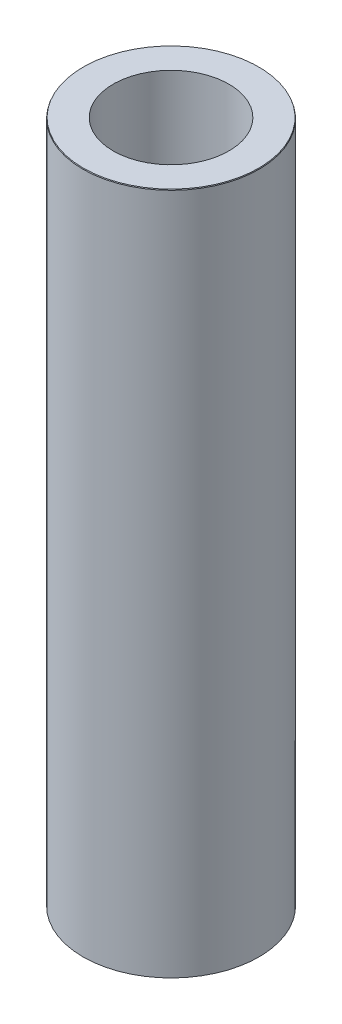
ISO-10303-21;
HEADER;
FILE_DESCRIPTION(('STEP AP214'),'2;1');
FILE_NAME('part.step','',(''),(''),'','','');
FILE_SCHEMA(('AUTOMOTIVE_DESIGN { 1 0 10303 214 1 1 1 1 }'));
ENDSEC;
DATA;
#1=APPLICATION_CONTEXT('core data for automotive mechanical design processes');
#2=APPLICATION_PROTOCOL_DEFINITION('international standard','automotive_design',2000,#1);
#3=PRODUCT_CONTEXT('',#1,'mechanical');
#4=PRODUCT('Part','Part','',(#3));
#5=PRODUCT_RELATED_PRODUCT_CATEGORY('part','',(#4));
#6=PRODUCT_DEFINITION_FORMATION('','',#4);
#7=PRODUCT_DEFINITION_CONTEXT('part definition',#1,'design');
#8=PRODUCT_DEFINITION('design','',#6,#7);
#9=PRODUCT_DEFINITION_SHAPE('','',#8);
#10=(LENGTH_UNIT() NAMED_UNIT(*) SI_UNIT(.MILLI.,.METRE.));
#11=(NAMED_UNIT(*) PLANE_ANGLE_UNIT() SI_UNIT($,.RADIAN.));
#12=(NAMED_UNIT(*) SI_UNIT($,.STERADIAN.) SOLID_ANGLE_UNIT());
#13=UNCERTAINTY_MEASURE_WITH_UNIT(LENGTH_MEASURE(1.E-05),#10,'distance_accuracy_value','');
#14=(GEOMETRIC_REPRESENTATION_CONTEXT(3) GLOBAL_UNCERTAINTY_ASSIGNED_CONTEXT((#13)) GLOBAL_UNIT_ASSIGNED_CONTEXT((#10,
#11,#12)) REPRESENTATION_CONTEXT('',''));
#15=CARTESIAN_POINT('',(0.,0.,0.));
#16=DIRECTION('',(0.,0.,1.));
#17=DIRECTION('',(1.,0.,0.));
#18=AXIS2_PLACEMENT_3D('',#15,#16,#17);
#19=CARTESIAN_POINT('',(0.,174.669504837806,0.));
#20=DIRECTION('',(0.,-1.,0.));
#21=DIRECTION('',(0.,0.,-1.));
#22=AXIS2_PLACEMENT_3D('',#19,#20,#21);
#23=CYLINDRICAL_SURFACE('',#22,22.5);
#24=CARTESIAN_POINT('',(0.,174.454601087856,0.));
#25=DIRECTION('',(0.,1.,0.));
#26=DIRECTION('',(0.,0.,1.));
#27=AXIS2_PLACEMENT_3D('',#24,#25,#26);
#28=CIRCLE('',#27,22.5);
#29=CARTESIAN_POINT('',(0.,174.454601087856,22.5));
#30=VERTEX_POINT('',#29);
#31=EDGE_CURVE('E50',#30,#30,#28,.F.);
#32=ORIENTED_EDGE('',*,*,#31,.T.);
#33=EDGE_LOOP('',(#32));
#34=FACE_BOUND('',#33,.T.);
#35=CARTESIAN_POINT('',(0.,0.0818821600322983,0.));
#36=DIRECTION('',(0.,1.,0.));
#37=DIRECTION('',(0.,0.,1.));
#38=AXIS2_PLACEMENT_3D('',#35,#36,#37);
#39=CIRCLE('',#38,22.5);
#40=CARTESIAN_POINT('',(0.,0.0818821600322983,22.5));
#41=VERTEX_POINT('',#40);
#42=EDGE_CURVE('E51',#41,#41,#39,.T.);
#43=ORIENTED_EDGE('',*,*,#42,.T.);
#44=EDGE_LOOP('',(#43));
#45=FACE_BOUND('',#44,.T.);
#46=ADVANCED_FACE('F39',(#34,#45),#23,.T.);
#47=CARTESIAN_POINT('',(0.,174.669504837806,0.));
#48=DIRECTION('',(0.,1.,0.));
#49=DIRECTION('',(0.,0.,1.));
#50=AXIS2_PLACEMENT_3D('',#47,#48,#49);
#51=PLANE('',#50);
#52=CARTESIAN_POINT('',(0.,174.669504837806,0.));
#53=DIRECTION('',(0.,1.,0.));
#54=DIRECTION('',(0.,0.,1.));
#55=AXIS2_PLACEMENT_3D('',#52,#53,#54);
#56=CIRCLE('',#55,22.4181178399677);
#57=CARTESIAN_POINT('',(0.,174.669504837806,22.4181178399677));
#58=VERTEX_POINT('',#57);
#59=EDGE_CURVE('E54',#58,#58,#56,.T.);
#60=ORIENTED_EDGE('',*,*,#59,.T.);
#61=EDGE_LOOP('',(#60));
#62=FACE_BOUND('',#61,.T.);
#63=CARTESIAN_POINT('',(0.,174.669504837806,0.));
#64=DIRECTION('',(0.,1.,0.));
#65=DIRECTION('',(0.,0.,1.));
#66=AXIS2_PLACEMENT_3D('',#63,#64,#65);
#67=CIRCLE('',#66,14.7980477539687);
#68=CARTESIAN_POINT('',(0.,174.669504837806,14.7980477539687));
#69=VERTEX_POINT('',#68);
#70=EDGE_CURVE('E58',#69,#69,#67,.T.);
#71=ORIENTED_EDGE('',*,*,#70,.F.);
#72=EDGE_LOOP('',(#71));
#73=FACE_BOUND('',#72,.T.);
#74=ADVANCED_FACE('F69',(#62,#73),#51,.T.);
#75=CARTESIAN_POINT('',(0.,0.,0.));
#76=DIRECTION('',(0.,1.,0.));
#77=DIRECTION('',(0.,0.,1.));
#78=AXIS2_PLACEMENT_3D('',#75,#76,#77);
#79=PLANE('',#78);
#80=CARTESIAN_POINT('',(0.,0.,0.));
#81=DIRECTION('',(0.,1.,0.));
#82=DIRECTION('',(0.,0.,1.));
#83=AXIS2_PLACEMENT_3D('',#80,#81,#82);
#84=CIRCLE('',#83,22.2850962500493);
#85=CARTESIAN_POINT('',(0.,0.,22.2850962500493));
#86=VERTEX_POINT('',#85);
#87=EDGE_CURVE('E10',#86,#86,#84,.F.);
#88=ORIENTED_EDGE('',*,*,#87,.T.);
#89=EDGE_LOOP('',(#88));
#90=FACE_BOUND('',#89,.T.);
#91=CARTESIAN_POINT('',(0.,0.,0.));
#92=DIRECTION('',(0.,1.,0.));
#93=DIRECTION('',(0.,0.,1.));
#94=AXIS2_PLACEMENT_3D('',#91,#92,#93);
#95=CIRCLE('',#94,14.7980477539687);
#96=CARTESIAN_POINT('',(0.,0.,14.7980477539687));
#97=VERTEX_POINT('',#96);
#98=EDGE_CURVE('E63',#97,#97,#95,.T.);
#99=ORIENTED_EDGE('',*,*,#98,.T.);
#100=EDGE_LOOP('',(#99));
#101=FACE_BOUND('',#100,.T.);
#102=ADVANCED_FACE('F75',(#90,#101),#79,.F.);
#103=CARTESIAN_POINT('',(0.,174.669504837806,0.));
#104=DIRECTION('',(0.,-1.,0.));
#105=DIRECTION('',(0.,0.,-1.));
#106=AXIS2_PLACEMENT_3D('',#103,#104,#105);
#107=CYLINDRICAL_SURFACE('',#106,14.7980477539687);
#108=ORIENTED_EDGE('',*,*,#70,.T.);
#109=EDGE_LOOP('',(#108));
#110=FACE_BOUND('',#109,.T.);
#111=ORIENTED_EDGE('',*,*,#98,.F.);
#112=EDGE_LOOP('',(#111));
#113=FACE_BOUND('',#112,.T.);
#114=ADVANCED_FACE('F70',(#110,#113),#107,.F.);
#115=CARTESIAN_POINT('',(0.,174.669504837806,0.));
#116=DIRECTION('',(0.,-1.,0.));
#117=DIRECTION('',(0.,0.,-1.));
#118=AXIS2_PLACEMENT_3D('',#115,#116,#117);
#119=CONICAL_SURFACE('',#118,22.4181178399677,0.364036108021559);
#120=ORIENTED_EDGE('',*,*,#31,.F.);
#121=EDGE_LOOP('',(#120));
#122=FACE_BOUND('',#121,.T.);
#123=ORIENTED_EDGE('',*,*,#59,.F.);
#124=EDGE_LOOP('',(#123));
#125=FACE_BOUND('',#124,.T.);
#126=ADVANCED_FACE('F81',(#122,#125),#119,.T.);
#127=CARTESIAN_POINT('',(0.,0.0818821600322983,0.));
#128=DIRECTION('',(0.,1.,0.));
#129=DIRECTION('',(0.,0.,1.));
#130=AXIS2_PLACEMENT_3D('',#127,#128,#129);
#131=CONICAL_SURFACE('',#130,22.5,1.20676021877334);
#132=ORIENTED_EDGE('',*,*,#87,.F.);
#133=EDGE_LOOP('',(#132));
#134=FACE_BOUND('',#133,.T.);
#135=ORIENTED_EDGE('',*,*,#42,.F.);
#136=EDGE_LOOP('',(#135));
#137=FACE_BOUND('',#136,.T.);
#138=ADVANCED_FACE('F45',(#134,#137),#131,.T.);
#139=CLOSED_SHELL('',(#46,#74,#102,#114,#126,#138));
#140=MANIFOLD_SOLID_BREP('B2',#139);
#141=ADVANCED_BREP_SHAPE_REPRESENTATION('',(#18,#140),#14);
#142=SHAPE_DEFINITION_REPRESENTATION(#9,#141);
ENDSEC;
END-ISO-10303-21;
